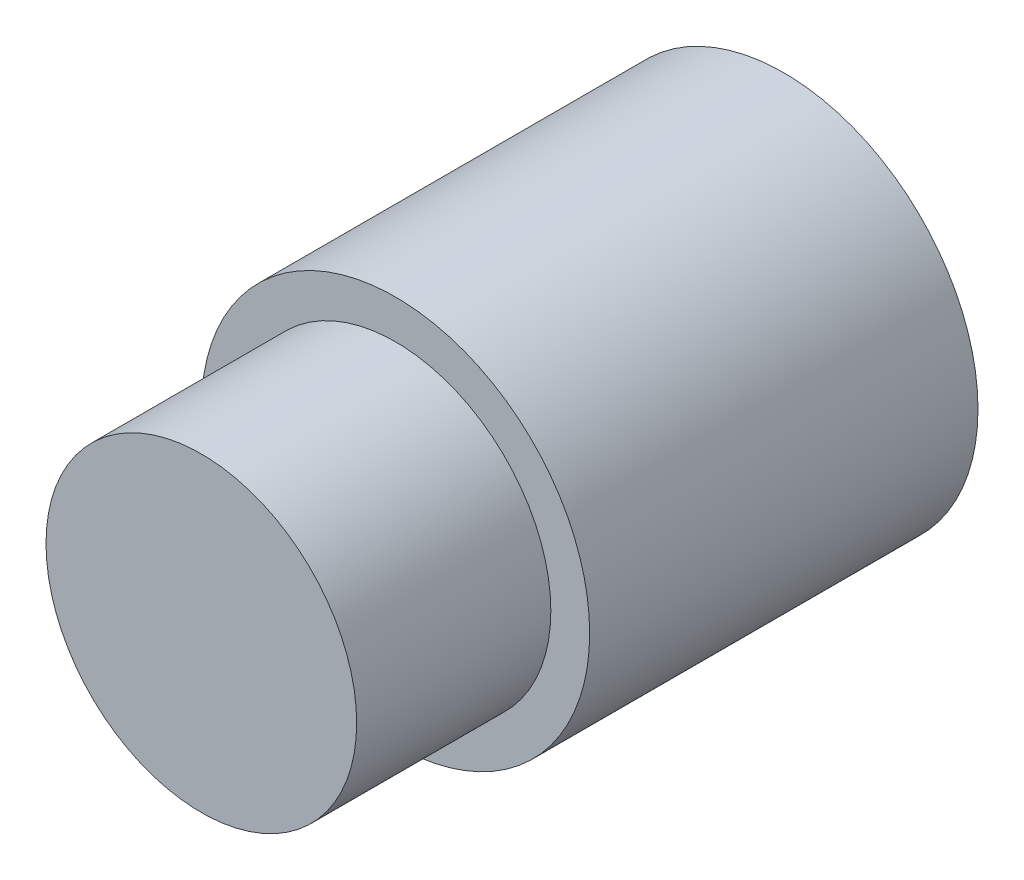
ISO-10303-21;
HEADER;
FILE_DESCRIPTION(('STEP AP214'),'2;1');
FILE_NAME('part.step','',(''),(''),'','','');
FILE_SCHEMA(('AUTOMOTIVE_DESIGN { 1 0 10303 214 1 1 1 1 }'));
ENDSEC;
DATA;
#1=APPLICATION_CONTEXT('core data for automotive mechanical design processes');
#2=APPLICATION_PROTOCOL_DEFINITION('international standard','automotive_design',2000,#1);
#3=PRODUCT_CONTEXT('',#1,'mechanical');
#4=PRODUCT('Part','Part','',(#3));
#5=PRODUCT_RELATED_PRODUCT_CATEGORY('part','',(#4));
#6=PRODUCT_DEFINITION_FORMATION('','',#4);
#7=PRODUCT_DEFINITION_CONTEXT('part definition',#1,'design');
#8=PRODUCT_DEFINITION('design','',#6,#7);
#9=PRODUCT_DEFINITION_SHAPE('','',#8);
#10=(LENGTH_UNIT() NAMED_UNIT(*) SI_UNIT(.MILLI.,.METRE.));
#11=(NAMED_UNIT(*) PLANE_ANGLE_UNIT() SI_UNIT($,.RADIAN.));
#12=(NAMED_UNIT(*) SI_UNIT($,.STERADIAN.) SOLID_ANGLE_UNIT());
#13=UNCERTAINTY_MEASURE_WITH_UNIT(LENGTH_MEASURE(1.E-05),#10,'distance_accuracy_value','');
#14=(GEOMETRIC_REPRESENTATION_CONTEXT(3) GLOBAL_UNCERTAINTY_ASSIGNED_CONTEXT((#13)) GLOBAL_UNIT_ASSIGNED_CONTEXT((#10,
#11,#12)) REPRESENTATION_CONTEXT('',''));
#15=CARTESIAN_POINT('',(0.,0.,0.));
#16=DIRECTION('',(0.,0.,1.));
#17=DIRECTION('',(1.,0.,0.));
#18=AXIS2_PLACEMENT_3D('',#15,#16,#17);
#19=CARTESIAN_POINT('',(0.,0.,20.));
#20=DIRECTION('',(0.,0.,-1.));
#21=DIRECTION('',(-1.,0.,0.));
#22=AXIS2_PLACEMENT_3D('',#19,#20,#21);
#23=CYLINDRICAL_SURFACE('',#22,10.);
#24=CARTESIAN_POINT('',(0.,0.,20.));
#25=DIRECTION('',(0.,0.,1.));
#26=DIRECTION('',(1.,0.,0.));
#27=AXIS2_PLACEMENT_3D('',#24,#25,#26);
#28=CIRCLE('',#27,10.);
#29=CARTESIAN_POINT('',(10.,0.,20.));
#30=VERTEX_POINT('',#29);
#31=EDGE_CURVE('E10',#30,#30,#28,.T.);
#32=ORIENTED_EDGE('',*,*,#31,.F.);
#33=EDGE_LOOP('',(#32));
#34=FACE_BOUND('',#33,.T.);
#35=CARTESIAN_POINT('',(0.,0.,0.));
#36=DIRECTION('',(0.,0.,1.));
#37=DIRECTION('',(1.,0.,0.));
#38=AXIS2_PLACEMENT_3D('',#35,#36,#37);
#39=CIRCLE('',#38,10.);
#40=CARTESIAN_POINT('',(10.,0.,0.));
#41=VERTEX_POINT('',#40);
#42=EDGE_CURVE('E34',#41,#41,#39,.T.);
#43=ORIENTED_EDGE('',*,*,#42,.T.);
#44=EDGE_LOOP('',(#43));
#45=FACE_BOUND('',#44,.T.);
#46=ADVANCED_FACE('F31',(#34,#45),#23,.T.);
#47=CARTESIAN_POINT('',(0.,0.,20.));
#48=DIRECTION('',(0.,0.,1.));
#49=DIRECTION('',(1.,0.,0.));
#50=AXIS2_PLACEMENT_3D('',#47,#48,#49);
#51=PLANE('',#50);
#52=CARTESIAN_POINT('',(0.,0.,20.));
#53=DIRECTION('',(0.,0.,1.));
#54=DIRECTION('',(1.,0.,0.));
#55=AXIS2_PLACEMENT_3D('',#52,#53,#54);
#56=CIRCLE('',#55,8.);
#57=CARTESIAN_POINT('',(8.,0.,20.));
#58=VERTEX_POINT('',#57);
#59=EDGE_CURVE('E49',#58,#58,#56,.T.);
#60=ORIENTED_EDGE('',*,*,#59,.F.);
#61=EDGE_LOOP('',(#60));
#62=FACE_BOUND('',#61,.T.);
#63=ORIENTED_EDGE('',*,*,#31,.T.);
#64=EDGE_LOOP('',(#63));
#65=FACE_BOUND('',#64,.T.);
#66=ADVANCED_FACE('F64',(#62,#65),#51,.T.);
#67=CARTESIAN_POINT('',(0.,0.,0.));
#68=DIRECTION('',(0.,0.,1.));
#69=DIRECTION('',(1.,0.,0.));
#70=AXIS2_PLACEMENT_3D('',#67,#68,#69);
#71=PLANE('',#70);
#72=CARTESIAN_POINT('',(0.,0.,0.));
#73=DIRECTION('',(0.,0.,-1.));
#74=DIRECTION('',(-1.,0.,0.));
#75=AXIS2_PLACEMENT_3D('',#72,#73,#74);
#76=CIRCLE('',#75,1.5);
#77=CARTESIAN_POINT('',(-1.5,0.,0.));
#78=VERTEX_POINT('',#77);
#79=EDGE_CURVE('E43',#78,#78,#76,.T.);
#80=ORIENTED_EDGE('',*,*,#79,.F.);
#81=EDGE_LOOP('',(#80));
#82=FACE_BOUND('',#81,.T.);
#83=ORIENTED_EDGE('',*,*,#42,.F.);
#84=EDGE_LOOP('',(#83));
#85=FACE_BOUND('',#84,.T.);
#86=ADVANCED_FACE('F66',(#82,#85),#71,.F.);
#87=CARTESIAN_POINT('',(0.,0.,10.));
#88=DIRECTION('',(0.,0.,-1.));
#89=DIRECTION('',(-1.,0.,0.));
#90=AXIS2_PLACEMENT_3D('',#87,#88,#89);
#91=CYLINDRICAL_SURFACE('',#90,1.5);
#92=CARTESIAN_POINT('',(0.,0.,10.));
#93=DIRECTION('',(0.,0.,-1.));
#94=DIRECTION('',(-1.,0.,0.));
#95=AXIS2_PLACEMENT_3D('',#92,#93,#94);
#96=CIRCLE('',#95,1.5);
#97=CARTESIAN_POINT('',(-1.5,0.,10.));
#98=VERTEX_POINT('',#97);
#99=EDGE_CURVE('E41',#98,#98,#96,.T.);
#100=ORIENTED_EDGE('',*,*,#99,.F.);
#101=EDGE_LOOP('',(#100));
#102=FACE_BOUND('',#101,.T.);
#103=ORIENTED_EDGE('',*,*,#79,.T.);
#104=EDGE_LOOP('',(#103));
#105=FACE_BOUND('',#104,.T.);
#106=ADVANCED_FACE('F72',(#102,#105),#91,.F.);
#107=CARTESIAN_POINT('',(0.,0.,10.));
#108=DIRECTION('',(0.,0.,-1.));
#109=DIRECTION('',(-1.,0.,0.));
#110=AXIS2_PLACEMENT_3D('',#107,#108,#109);
#111=PLANE('',#110);
#112=ORIENTED_EDGE('',*,*,#99,.T.);
#113=EDGE_LOOP('',(#112));
#114=FACE_BOUND('',#113,.T.);
#115=ADVANCED_FACE('F60',(#114),#111,.T.);
#116=CARTESIAN_POINT('',(0.,0.,30.));
#117=DIRECTION('',(0.,0.,-1.));
#118=DIRECTION('',(-1.,0.,0.));
#119=AXIS2_PLACEMENT_3D('',#116,#117,#118);
#120=CYLINDRICAL_SURFACE('',#119,8.);
#121=CARTESIAN_POINT('',(0.,0.,30.));
#122=DIRECTION('',(0.,0.,1.));
#123=DIRECTION('',(1.,0.,0.));
#124=AXIS2_PLACEMENT_3D('',#121,#122,#123);
#125=CIRCLE('',#124,8.);
#126=CARTESIAN_POINT('',(8.,0.,30.));
#127=VERTEX_POINT('',#126);
#128=EDGE_CURVE('E46',#127,#127,#125,.T.);
#129=ORIENTED_EDGE('',*,*,#128,.F.);
#130=EDGE_LOOP('',(#129));
#131=FACE_BOUND('',#130,.T.);
#132=ORIENTED_EDGE('',*,*,#59,.T.);
#133=EDGE_LOOP('',(#132));
#134=FACE_BOUND('',#133,.T.);
#135=ADVANCED_FACE('F57',(#131,#134),#120,.T.);
#136=CARTESIAN_POINT('',(0.,0.,30.));
#137=DIRECTION('',(0.,0.,1.));
#138=DIRECTION('',(1.,0.,0.));
#139=AXIS2_PLACEMENT_3D('',#136,#137,#138);
#140=PLANE('',#139);
#141=ORIENTED_EDGE('',*,*,#128,.T.);
#142=EDGE_LOOP('',(#141));
#143=FACE_BOUND('',#142,.T.);
#144=ADVANCED_FACE('F55',(#143),#140,.T.);
#145=CLOSED_SHELL('',(#46,#66,#86,#106,#115,#135,#144));
#146=MANIFOLD_SOLID_BREP('B2',#145);
#147=ADVANCED_BREP_SHAPE_REPRESENTATION('',(#18,#146),#14);
#148=SHAPE_DEFINITION_REPRESENTATION(#9,#147);
ENDSEC;
END-ISO-10303-21;
